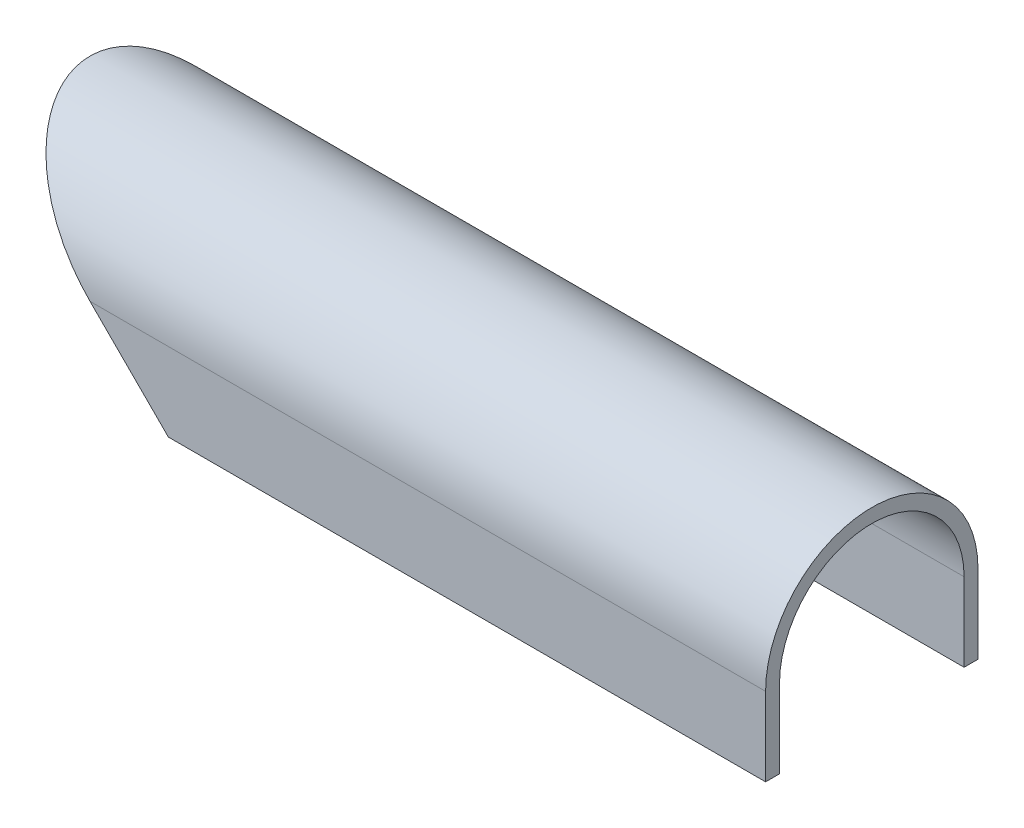
ISO-10303-21;
HEADER;
FILE_DESCRIPTION(('STEP AP214'),'2;1');
FILE_NAME('part.step','',(''),(''),'','','');
FILE_SCHEMA(('AUTOMOTIVE_DESIGN { 1 0 10303 214 1 1 1 1 }'));
ENDSEC;
DATA;
#1=APPLICATION_CONTEXT('core data for automotive mechanical design processes');
#2=APPLICATION_PROTOCOL_DEFINITION('international standard','automotive_design',2000,#1);
#3=PRODUCT_CONTEXT('',#1,'mechanical');
#4=PRODUCT('Part','Part','',(#3));
#5=PRODUCT_RELATED_PRODUCT_CATEGORY('part','',(#4));
#6=PRODUCT_DEFINITION_FORMATION('','',#4);
#7=PRODUCT_DEFINITION_CONTEXT('part definition',#1,'design');
#8=PRODUCT_DEFINITION('design','',#6,#7);
#9=PRODUCT_DEFINITION_SHAPE('','',#8);
#10=(LENGTH_UNIT() NAMED_UNIT(*) SI_UNIT(.MILLI.,.METRE.));
#11=(NAMED_UNIT(*) PLANE_ANGLE_UNIT() SI_UNIT($,.RADIAN.));
#12=(NAMED_UNIT(*) SI_UNIT($,.STERADIAN.) SOLID_ANGLE_UNIT());
#13=UNCERTAINTY_MEASURE_WITH_UNIT(LENGTH_MEASURE(1.E-05),#10,'distance_accuracy_value','');
#14=(GEOMETRIC_REPRESENTATION_CONTEXT(3) GLOBAL_UNCERTAINTY_ASSIGNED_CONTEXT((#13)) GLOBAL_UNIT_ASSIGNED_CONTEXT((#10,
#11,#12)) REPRESENTATION_CONTEXT('',''));
#15=CARTESIAN_POINT('',(0.,0.,0.));
#16=DIRECTION('',(0.,0.,1.));
#17=DIRECTION('',(1.,0.,0.));
#18=AXIS2_PLACEMENT_3D('',#15,#16,#17);
#19=CARTESIAN_POINT('',(228.6,-22.9235,31.0515));
#20=DIRECTION('',(0.,1.,0.));
#21=DIRECTION('',(0.,0.,1.));
#22=AXIS2_PLACEMENT_3D('',#19,#20,#21);
#23=PLANE('',#22);
#24=DIRECTION('',(-1.,0.,0.));
#25=VECTOR('',#24,1.);
#26=CARTESIAN_POINT('',(228.6,-22.9235,31.0515));
#27=LINE('',#26,#25);
#28=CARTESIAN_POINT('',(228.6,-22.9235,31.0515));
#29=VERTEX_POINT('',#28);
#30=CARTESIAN_POINT('',(53.9750000000006,-22.9235,31.0515));
#31=VERTEX_POINT('',#30);
#32=EDGE_CURVE('E110',#29,#31,#27,.T.);
#33=ORIENTED_EDGE('',*,*,#32,.T.);
#34=DIRECTION('',(0.,0.,-1.));
#35=VECTOR('',#34,1.);
#36=CARTESIAN_POINT('',(53.9750000000006,-22.9235,339.82759406959));
#37=LINE('',#36,#35);
#38=CARTESIAN_POINT('',(53.9750000000006,-22.9235,26.9875));
#39=VERTEX_POINT('',#38);
#40=EDGE_CURVE('E47',#31,#39,#37,.T.);
#41=ORIENTED_EDGE('',*,*,#40,.T.);
#42=DIRECTION('',(-1.,0.,0.));
#43=VECTOR('',#42,1.);
#44=CARTESIAN_POINT('',(228.6,-22.9235,26.9875));
#45=LINE('',#44,#43);
#46=CARTESIAN_POINT('',(228.6,-22.9235,26.9875));
#47=VERTEX_POINT('',#46);
#48=EDGE_CURVE('E11',#47,#39,#45,.T.);
#49=ORIENTED_EDGE('',*,*,#48,.F.);
#50=DIRECTION('',(0.,0.,-1.));
#51=VECTOR('',#50,1.);
#52=CARTESIAN_POINT('',(228.6,-22.9235,31.0515));
#53=LINE('',#52,#51);
#54=EDGE_CURVE('E104',#29,#47,#53,.T.);
#55=ORIENTED_EDGE('',*,*,#54,.F.);
#56=EDGE_LOOP('',(#33,#41,#49,#55));
#57=FACE_BOUND('',#56,.T.);
#58=ADVANCED_FACE('F33',(#57),#23,.F.);
#59=CARTESIAN_POINT('',(228.6,-22.9235,26.9875));
#60=DIRECTION('',(0.,0.,1.));
#61=DIRECTION('',(0.,-1.,0.));
#62=AXIS2_PLACEMENT_3D('',#59,#60,#61);
#63=PLANE('',#62);
#64=ORIENTED_EDGE('',*,*,#48,.T.);
#65=DIRECTION('',(-0.707106781186551,0.707106781186544,0.));
#66=VECTOR('',#65,1.);
#67=CARTESIAN_POINT('',(141.287500000001,-110.236,26.9875));
#68=LINE('',#67,#66);
#69=CARTESIAN_POINT('',(31.0515000000003,0.,26.9875));
#70=VERTEX_POINT('',#69);
#71=EDGE_CURVE('E97',#39,#70,#68,.T.);
#72=ORIENTED_EDGE('',*,*,#71,.T.);
#73=DIRECTION('',(-1.,0.,0.));
#74=VECTOR('',#73,1.);
#75=CARTESIAN_POINT('',(228.6,0.,26.9875));
#76=LINE('',#75,#74);
#77=CARTESIAN_POINT('',(228.6,0.,26.9875));
#78=VERTEX_POINT('',#77);
#79=EDGE_CURVE('E40',#78,#70,#76,.T.);
#80=ORIENTED_EDGE('',*,*,#79,.F.);
#81=DIRECTION('',(0.,1.,0.));
#82=VECTOR('',#81,1.);
#83=CARTESIAN_POINT('',(228.6,-22.9235,26.9875));
#84=LINE('',#83,#82);
#85=EDGE_CURVE('E115',#47,#78,#84,.T.);
#86=ORIENTED_EDGE('',*,*,#85,.F.);
#87=EDGE_LOOP('',(#64,#72,#80,#86));
#88=FACE_BOUND('',#87,.T.);
#89=ADVANCED_FACE('F114',(#88),#63,.F.);
#90=CARTESIAN_POINT('',(228.6,0.,0.));
#91=DIRECTION('',(-1.,0.,0.));
#92=DIRECTION('',(0.,0.,1.));
#93=AXIS2_PLACEMENT_3D('',#90,#91,#92);
#94=CYLINDRICAL_SURFACE('',#93,26.9875);
#95=ORIENTED_EDGE('',*,*,#79,.T.);
#96=CARTESIAN_POINT('',(31.0515000000003,0.,0.));
#97=DIRECTION('',(0.707106781186544,0.707106781186551,0.));
#98=DIRECTION('',(-0.707106781186551,0.707106781186544,0.));
#99=AXIS2_PLACEMENT_3D('',#96,#97,#98);
#100=ELLIPSE('',#99,38.1660885145441,26.9875);
#101=CARTESIAN_POINT('',(31.0515000000003,0.,-26.9875));
#102=VERTEX_POINT('',#101);
#103=EDGE_CURVE('E100',#70,#102,#100,.F.);
#104=ORIENTED_EDGE('',*,*,#103,.T.);
#105=DIRECTION('',(-1.,0.,0.));
#106=VECTOR('',#105,1.);
#107=CARTESIAN_POINT('',(228.6,0.,-26.9875));
#108=LINE('',#107,#106);
#109=CARTESIAN_POINT('',(228.6,0.,-26.9875));
#110=VERTEX_POINT('',#109);
#111=EDGE_CURVE('E146',#110,#102,#108,.T.);
#112=ORIENTED_EDGE('',*,*,#111,.F.);
#113=CARTESIAN_POINT('',(228.6,0.,0.));
#114=DIRECTION('',(-1.,0.,0.));
#115=DIRECTION('',(0.,0.,1.));
#116=AXIS2_PLACEMENT_3D('',#113,#114,#115);
#117=CIRCLE('',#116,26.9875);
#118=EDGE_CURVE('E117',#78,#110,#117,.T.);
#119=ORIENTED_EDGE('',*,*,#118,.F.);
#120=EDGE_LOOP('',(#95,#104,#112,#119));
#121=FACE_BOUND('',#120,.T.);
#122=ADVANCED_FACE('F149',(#121),#94,.F.);
#123=CARTESIAN_POINT('',(228.6,0.,-26.9875));
#124=DIRECTION('',(0.,0.,-1.));
#125=DIRECTION('',(0.,1.,0.));
#126=AXIS2_PLACEMENT_3D('',#123,#124,#125);
#127=PLANE('',#126);
#128=ORIENTED_EDGE('',*,*,#111,.T.);
#129=DIRECTION('',(0.707106781186551,-0.707106781186544,0.));
#130=VECTOR('',#129,1.);
#131=CARTESIAN_POINT('',(129.825750000001,-98.7742499999998,-26.9875));
#132=LINE('',#131,#130);
#133=CARTESIAN_POINT('',(53.9750000000006,-22.9235,-26.9875));
#134=VERTEX_POINT('',#133);
#135=EDGE_CURVE('E158',#102,#134,#132,.T.);
#136=ORIENTED_EDGE('',*,*,#135,.T.);
#137=DIRECTION('',(-1.,0.,0.));
#138=VECTOR('',#137,1.);
#139=CARTESIAN_POINT('',(228.6,-22.9235,-26.9875));
#140=LINE('',#139,#138);
#141=CARTESIAN_POINT('',(228.6,-22.9235,-26.9875));
#142=VERTEX_POINT('',#141);
#143=EDGE_CURVE('E143',#142,#134,#140,.T.);
#144=ORIENTED_EDGE('',*,*,#143,.F.);
#145=DIRECTION('',(0.,-1.,0.));
#146=VECTOR('',#145,1.);
#147=CARTESIAN_POINT('',(228.6,0.,-26.9875));
#148=LINE('',#147,#146);
#149=EDGE_CURVE('E124',#110,#142,#148,.T.);
#150=ORIENTED_EDGE('',*,*,#149,.F.);
#151=EDGE_LOOP('',(#128,#136,#144,#150));
#152=FACE_BOUND('',#151,.T.);
#153=ADVANCED_FACE('F157',(#152),#127,.F.);
#154=CARTESIAN_POINT('',(228.6,-22.9235,-26.9875));
#155=DIRECTION('',(0.,1.,0.));
#156=DIRECTION('',(0.,0.,1.));
#157=AXIS2_PLACEMENT_3D('',#154,#155,#156);
#158=PLANE('',#157);
#159=ORIENTED_EDGE('',*,*,#143,.T.);
#160=CARTESIAN_POINT('',(53.9750000000006,-22.9235,-31.0515));
#161=VERTEX_POINT('',#160);
#162=EDGE_CURVE('E112',#134,#161,#37,.T.);
#163=ORIENTED_EDGE('',*,*,#162,.T.);
#164=DIRECTION('',(-1.,0.,0.));
#165=VECTOR('',#164,1.);
#166=CARTESIAN_POINT('',(228.6,-22.9235,-31.0515));
#167=LINE('',#166,#165);
#168=CARTESIAN_POINT('',(228.6,-22.9235,-31.0515));
#169=VERTEX_POINT('',#168);
#170=EDGE_CURVE('E140',#169,#161,#167,.T.);
#171=ORIENTED_EDGE('',*,*,#170,.F.);
#172=DIRECTION('',(0.,0.,-1.));
#173=VECTOR('',#172,1.);
#174=CARTESIAN_POINT('',(228.6,-22.9235,-26.9875));
#175=LINE('',#174,#173);
#176=EDGE_CURVE('E126',#142,#169,#175,.T.);
#177=ORIENTED_EDGE('',*,*,#176,.F.);
#178=EDGE_LOOP('',(#159,#163,#171,#177));
#179=FACE_BOUND('',#178,.T.);
#180=ADVANCED_FACE('F161',(#179),#158,.F.);
#181=CARTESIAN_POINT('',(228.6,-22.9235,-31.0515));
#182=DIRECTION('',(0.,0.,1.));
#183=DIRECTION('',(0.,-1.,0.));
#184=AXIS2_PLACEMENT_3D('',#181,#182,#183);
#185=PLANE('',#184);
#186=ORIENTED_EDGE('',*,*,#170,.T.);
#187=DIRECTION('',(-0.707106781186551,0.707106781186544,0.));
#188=VECTOR('',#187,1.);
#189=CARTESIAN_POINT('',(141.287500000001,-110.236,-31.0515));
#190=LINE('',#189,#188);
#191=CARTESIAN_POINT('',(31.0515000000003,0.,-31.0515));
#192=VERTEX_POINT('',#191);
#193=EDGE_CURVE('E175',#161,#192,#190,.T.);
#194=ORIENTED_EDGE('',*,*,#193,.T.);
#195=DIRECTION('',(-1.,0.,0.));
#196=VECTOR('',#195,1.);
#197=CARTESIAN_POINT('',(228.6,0.,-31.0515));
#198=LINE('',#197,#196);
#199=CARTESIAN_POINT('',(228.6,0.,-31.0515));
#200=VERTEX_POINT('',#199);
#201=EDGE_CURVE('E137',#200,#192,#198,.T.);
#202=ORIENTED_EDGE('',*,*,#201,.F.);
#203=DIRECTION('',(0.,1.,0.));
#204=VECTOR('',#203,1.);
#205=CARTESIAN_POINT('',(228.6,-22.9235,-31.0515));
#206=LINE('',#205,#204);
#207=EDGE_CURVE('E128',#169,#200,#206,.T.);
#208=ORIENTED_EDGE('',*,*,#207,.F.);
#209=EDGE_LOOP('',(#186,#194,#202,#208));
#210=FACE_BOUND('',#209,.T.);
#211=ADVANCED_FACE('F166',(#210),#185,.F.);
#212=CARTESIAN_POINT('',(228.6,0.,0.));
#213=DIRECTION('',(-1.,0.,0.));
#214=DIRECTION('',(0.,0.,1.));
#215=AXIS2_PLACEMENT_3D('',#212,#213,#214);
#216=CYLINDRICAL_SURFACE('',#215,31.0515);
#217=CARTESIAN_POINT('',(31.0515000000003,0.,0.));
#218=DIRECTION('',(0.707106781186544,0.707106781186551,0.));
#219=DIRECTION('',(-0.707106781186551,0.707106781186544,0.));
#220=AXIS2_PLACEMENT_3D('',#217,#218,#219);
#221=ELLIPSE('',#220,43.9134524320284,31.0515);
#222=CARTESIAN_POINT('',(31.0515000000003,0.,31.0515));
#223=VERTEX_POINT('',#222);
#224=EDGE_CURVE('E171',#192,#223,#221,.T.);
#225=ORIENTED_EDGE('',*,*,#224,.T.);
#226=DIRECTION('',(-1.,0.,0.));
#227=VECTOR('',#226,1.);
#228=CARTESIAN_POINT('',(228.6,0.,31.0515));
#229=LINE('',#228,#227);
#230=CARTESIAN_POINT('',(228.6,0.,31.0515));
#231=VERTEX_POINT('',#230);
#232=EDGE_CURVE('E134',#231,#223,#229,.T.);
#233=ORIENTED_EDGE('',*,*,#232,.F.);
#234=CARTESIAN_POINT('',(228.6,0.,0.));
#235=DIRECTION('',(1.,0.,0.));
#236=DIRECTION('',(0.,0.,1.));
#237=AXIS2_PLACEMENT_3D('',#234,#235,#236);
#238=CIRCLE('',#237,31.0515);
#239=EDGE_CURVE('E130',#200,#231,#238,.T.);
#240=ORIENTED_EDGE('',*,*,#239,.F.);
#241=ORIENTED_EDGE('',*,*,#201,.T.);
#242=EDGE_LOOP('',(#225,#233,#240,#241));
#243=FACE_BOUND('',#242,.T.);
#244=ADVANCED_FACE('F170',(#243),#216,.T.);
#245=CARTESIAN_POINT('',(228.6,-22.9235,31.0515));
#246=DIRECTION('',(0.,0.,-1.));
#247=DIRECTION('',(0.,1.,0.));
#248=AXIS2_PLACEMENT_3D('',#245,#246,#247);
#249=PLANE('',#248);
#250=ORIENTED_EDGE('',*,*,#232,.T.);
#251=DIRECTION('',(0.707106781186551,-0.707106781186544,0.));
#252=VECTOR('',#251,1.);
#253=CARTESIAN_POINT('',(141.287500000001,-110.236,31.0515));
#254=LINE('',#253,#252);
#255=EDGE_CURVE('E111',#223,#31,#254,.T.);
#256=ORIENTED_EDGE('',*,*,#255,.T.);
#257=ORIENTED_EDGE('',*,*,#32,.F.);
#258=DIRECTION('',(0.,-1.,0.));
#259=VECTOR('',#258,1.);
#260=CARTESIAN_POINT('',(228.6,-22.9235,31.0515));
#261=LINE('',#260,#259);
#262=EDGE_CURVE('E55',#231,#29,#261,.T.);
#263=ORIENTED_EDGE('',*,*,#262,.F.);
#264=EDGE_LOOP('',(#250,#256,#257,#263));
#265=FACE_BOUND('',#264,.T.);
#266=ADVANCED_FACE('F173',(#265),#249,.F.);
#267=CARTESIAN_POINT('',(228.6,0.,0.));
#268=DIRECTION('',(-1.,0.,0.));
#269=DIRECTION('',(0.,0.,1.));
#270=AXIS2_PLACEMENT_3D('',#267,#268,#269);
#271=PLANE('',#270);
#272=ORIENTED_EDGE('',*,*,#54,.T.);
#273=ORIENTED_EDGE('',*,*,#85,.T.);
#274=ORIENTED_EDGE('',*,*,#118,.T.);
#275=ORIENTED_EDGE('',*,*,#149,.T.);
#276=ORIENTED_EDGE('',*,*,#176,.T.);
#277=ORIENTED_EDGE('',*,*,#207,.T.);
#278=ORIENTED_EDGE('',*,*,#239,.T.);
#279=ORIENTED_EDGE('',*,*,#262,.T.);
#280=EDGE_LOOP('',(#272,#273,#274,#275,#276,#277,#278,#279));
#281=FACE_BOUND('',#280,.T.);
#282=ADVANCED_FACE('F119',(#281),#271,.F.);
#283=CARTESIAN_POINT('',(0.,31.0515,339.82759406959));
#284=DIRECTION('',(0.707106781186544,0.707106781186551,0.));
#285=DIRECTION('',(-0.707106781186551,0.707106781186544,0.));
#286=AXIS2_PLACEMENT_3D('',#283,#284,#285);
#287=PLANE('',#286);
#288=ORIENTED_EDGE('',*,*,#71,.F.);
#289=ORIENTED_EDGE('',*,*,#40,.F.);
#290=ORIENTED_EDGE('',*,*,#255,.F.);
#291=ORIENTED_EDGE('',*,*,#224,.F.);
#292=ORIENTED_EDGE('',*,*,#193,.F.);
#293=ORIENTED_EDGE('',*,*,#162,.F.);
#294=ORIENTED_EDGE('',*,*,#135,.F.);
#295=ORIENTED_EDGE('',*,*,#103,.F.);
#296=EDGE_LOOP('',(#288,#289,#290,#291,#292,#293,#294,#295));
#297=FACE_BOUND('',#296,.T.);
#298=ADVANCED_FACE('F98',(#297),#287,.F.);
#299=CLOSED_SHELL('',(#58,#89,#122,#153,#180,#211,#244,#266,#282,#298));
#300=MANIFOLD_SOLID_BREP('B2',#299);
#301=ADVANCED_BREP_SHAPE_REPRESENTATION('',(#18,#300),#14);
#302=SHAPE_DEFINITION_REPRESENTATION(#9,#301);
ENDSEC;
END-ISO-10303-21;
